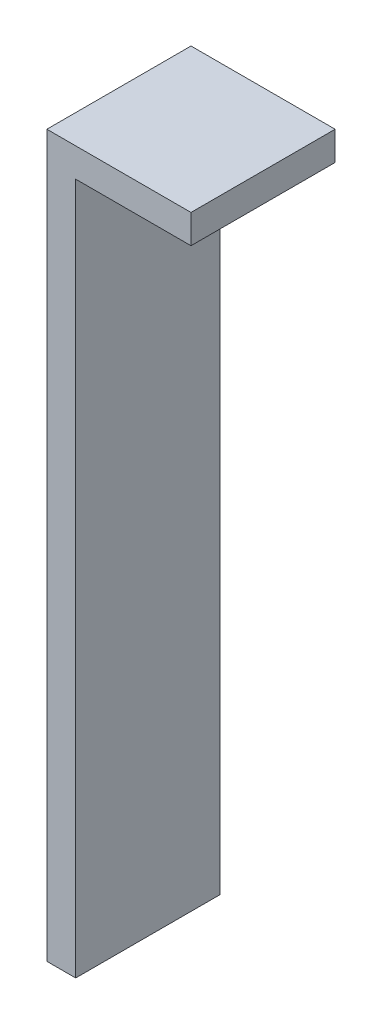
ISO-10303-21;
HEADER;
FILE_DESCRIPTION(('STEP AP214'),'2;1');
FILE_NAME('part.step','',(''),(''),'','','');
FILE_SCHEMA(('AUTOMOTIVE_DESIGN { 1 0 10303 214 1 1 1 1 }'));
ENDSEC;
DATA;
#1=APPLICATION_CONTEXT('core data for automotive mechanical design processes');
#2=APPLICATION_PROTOCOL_DEFINITION('international standard','automotive_design',2000,#1);
#3=PRODUCT_CONTEXT('',#1,'mechanical');
#4=PRODUCT('Part','Part','',(#3));
#5=PRODUCT_RELATED_PRODUCT_CATEGORY('part','',(#4));
#6=PRODUCT_DEFINITION_FORMATION('','',#4);
#7=PRODUCT_DEFINITION_CONTEXT('part definition',#1,'design');
#8=PRODUCT_DEFINITION('design','',#6,#7);
#9=PRODUCT_DEFINITION_SHAPE('','',#8);
#10=(LENGTH_UNIT() NAMED_UNIT(*) SI_UNIT(.MILLI.,.METRE.));
#11=(NAMED_UNIT(*) PLANE_ANGLE_UNIT() SI_UNIT($,.RADIAN.));
#12=(NAMED_UNIT(*) SI_UNIT($,.STERADIAN.) SOLID_ANGLE_UNIT());
#13=UNCERTAINTY_MEASURE_WITH_UNIT(LENGTH_MEASURE(1.E-05),#10,'distance_accuracy_value','');
#14=(GEOMETRIC_REPRESENTATION_CONTEXT(3) GLOBAL_UNCERTAINTY_ASSIGNED_CONTEXT((#13)) GLOBAL_UNIT_ASSIGNED_CONTEXT((#10,
#11,#12)) REPRESENTATION_CONTEXT('',''));
#15=CARTESIAN_POINT('',(0.,0.,0.));
#16=DIRECTION('',(0.,0.,1.));
#17=DIRECTION('',(1.,0.,0.));
#18=AXIS2_PLACEMENT_3D('',#15,#16,#17);
#19=CARTESIAN_POINT('',(0.,-0.2,0.5));
#20=DIRECTION('',(-1.,0.,0.));
#21=DIRECTION('',(0.,0.,1.));
#22=AXIS2_PLACEMENT_3D('',#19,#20,#21);
#23=PLANE('',#22);
#24=DIRECTION('',(0.,1.,0.));
#25=VECTOR('',#24,1.);
#26=CARTESIAN_POINT('',(0.,-0.2,-0.5));
#27=LINE('',#26,#25);
#28=CARTESIAN_POINT('',(0.,-0.2,-0.5));
#29=VERTEX_POINT('',#28);
#30=CARTESIAN_POINT('',(0.,0.,-0.5));
#31=VERTEX_POINT('',#30);
#32=EDGE_CURVE('E116',#29,#31,#27,.T.);
#33=ORIENTED_EDGE('',*,*,#32,.T.);
#34=DIRECTION('',(0.,0.,-1.));
#35=VECTOR('',#34,1.);
#36=CARTESIAN_POINT('',(0.,0.,0.5));
#37=LINE('',#36,#35);
#38=CARTESIAN_POINT('',(0.,0.,0.5));
#39=VERTEX_POINT('',#38);
#40=EDGE_CURVE('E11',#39,#31,#37,.T.);
#41=ORIENTED_EDGE('',*,*,#40,.F.);
#42=DIRECTION('',(0.,1.,0.));
#43=VECTOR('',#42,1.);
#44=CARTESIAN_POINT('',(0.,-0.2,0.5));
#45=LINE('',#44,#43);
#46=CARTESIAN_POINT('',(0.,-0.2,0.5));
#47=VERTEX_POINT('',#46);
#48=EDGE_CURVE('E126',#47,#39,#45,.T.);
#49=ORIENTED_EDGE('',*,*,#48,.F.);
#50=DIRECTION('',(0.,0.,-1.));
#51=VECTOR('',#50,1.);
#52=CARTESIAN_POINT('',(0.,-0.2,0.5));
#53=LINE('',#52,#51);
#54=EDGE_CURVE('E112',#47,#29,#53,.T.);
#55=ORIENTED_EDGE('',*,*,#54,.T.);
#56=EDGE_LOOP('',(#33,#41,#49,#55));
#57=FACE_BOUND('',#56,.T.);
#58=ADVANCED_FACE('F32',(#57),#23,.F.);
#59=CARTESIAN_POINT('',(0.,0.,0.5));
#60=DIRECTION('',(0.,-1.,0.));
#61=DIRECTION('',(1.,0.,0.));
#62=AXIS2_PLACEMENT_3D('',#59,#60,#61);
#63=PLANE('',#62);
#64=DIRECTION('',(-1.,0.,0.));
#65=VECTOR('',#64,1.);
#66=CARTESIAN_POINT('',(0.,0.,-0.5));
#67=LINE('',#66,#65);
#68=CARTESIAN_POINT('',(-1.,0.,-0.5));
#69=VERTEX_POINT('',#68);
#70=EDGE_CURVE('E119',#31,#69,#67,.T.);
#71=ORIENTED_EDGE('',*,*,#70,.T.);
#72=DIRECTION('',(0.,0.,-1.));
#73=VECTOR('',#72,1.);
#74=CARTESIAN_POINT('',(-1.,0.,0.5));
#75=LINE('',#74,#73);
#76=CARTESIAN_POINT('',(-1.,0.,0.5));
#77=VERTEX_POINT('',#76);
#78=EDGE_CURVE('E40',#77,#69,#75,.T.);
#79=ORIENTED_EDGE('',*,*,#78,.F.);
#80=DIRECTION('',(-1.,0.,0.));
#81=VECTOR('',#80,1.);
#82=CARTESIAN_POINT('',(0.,0.,0.5));
#83=LINE('',#82,#81);
#84=EDGE_CURVE('E85',#39,#77,#83,.T.);
#85=ORIENTED_EDGE('',*,*,#84,.F.);
#86=ORIENTED_EDGE('',*,*,#40,.T.);
#87=EDGE_LOOP('',(#71,#79,#85,#86));
#88=FACE_BOUND('',#87,.T.);
#89=ADVANCED_FACE('F150',(#88),#63,.F.);
#90=CARTESIAN_POINT('',(-1.,0.,0.5));
#91=DIRECTION('',(1.,0.,0.));
#92=DIRECTION('',(0.,1.,0.));
#93=AXIS2_PLACEMENT_3D('',#90,#91,#92);
#94=PLANE('',#93);
#95=DIRECTION('',(0.,-1.,0.));
#96=VECTOR('',#95,1.);
#97=CARTESIAN_POINT('',(-1.,0.,-0.5));
#98=LINE('',#97,#96);
#99=CARTESIAN_POINT('',(-1.,-5.,-0.5));
#100=VERTEX_POINT('',#99);
#101=EDGE_CURVE('E121',#69,#100,#98,.T.);
#102=ORIENTED_EDGE('',*,*,#101,.T.);
#103=DIRECTION('',(0.,0.,-1.));
#104=VECTOR('',#103,1.);
#105=CARTESIAN_POINT('',(-1.,-5.,0.5));
#106=LINE('',#105,#104);
#107=CARTESIAN_POINT('',(-1.,-5.,0.5));
#108=VERTEX_POINT('',#107);
#109=EDGE_CURVE('E107',#108,#100,#106,.T.);
#110=ORIENTED_EDGE('',*,*,#109,.F.);
#111=DIRECTION('',(0.,-1.,0.));
#112=VECTOR('',#111,1.);
#113=CARTESIAN_POINT('',(-1.,0.,0.5));
#114=LINE('',#113,#112);
#115=EDGE_CURVE('E98',#77,#108,#114,.T.);
#116=ORIENTED_EDGE('',*,*,#115,.F.);
#117=ORIENTED_EDGE('',*,*,#78,.T.);
#118=EDGE_LOOP('',(#102,#110,#116,#117));
#119=FACE_BOUND('',#118,.T.);
#120=ADVANCED_FACE('F132',(#119),#94,.F.);
#121=CARTESIAN_POINT('',(-1.,-5.,0.5));
#122=DIRECTION('',(0.,1.,0.));
#123=DIRECTION('',(0.,0.,1.));
#124=AXIS2_PLACEMENT_3D('',#121,#122,#123);
#125=PLANE('',#124);
#126=DIRECTION('',(1.,0.,0.));
#127=VECTOR('',#126,1.);
#128=CARTESIAN_POINT('',(-1.,-5.,-0.5));
#129=LINE('',#128,#127);
#130=CARTESIAN_POINT('',(-0.799999999999999,-5.,-0.5));
#131=VERTEX_POINT('',#130);
#132=EDGE_CURVE('E106',#100,#131,#129,.T.);
#133=ORIENTED_EDGE('',*,*,#132,.T.);
#134=DIRECTION('',(0.,0.,-1.));
#135=VECTOR('',#134,1.);
#136=CARTESIAN_POINT('',(-0.799999999999999,-5.,0.5));
#137=LINE('',#136,#135);
#138=CARTESIAN_POINT('',(-0.799999999999999,-5.,0.5));
#139=VERTEX_POINT('',#138);
#140=EDGE_CURVE('E103',#139,#131,#137,.T.);
#141=ORIENTED_EDGE('',*,*,#140,.F.);
#142=DIRECTION('',(1.,0.,0.));
#143=VECTOR('',#142,1.);
#144=CARTESIAN_POINT('',(-1.,-5.,0.5));
#145=LINE('',#144,#143);
#146=EDGE_CURVE('E92',#108,#139,#145,.T.);
#147=ORIENTED_EDGE('',*,*,#146,.F.);
#148=ORIENTED_EDGE('',*,*,#109,.T.);
#149=EDGE_LOOP('',(#133,#141,#147,#148));
#150=FACE_BOUND('',#149,.T.);
#151=ADVANCED_FACE('F104',(#150),#125,.F.);
#152=CARTESIAN_POINT('',(-0.799999999999999,-5.,0.5));
#153=DIRECTION('',(-1.,0.,0.));
#154=DIRECTION('',(0.,-1.,0.));
#155=AXIS2_PLACEMENT_3D('',#152,#153,#154);
#156=PLANE('',#155);
#157=DIRECTION('',(0.,1.,0.));
#158=VECTOR('',#157,1.);
#159=CARTESIAN_POINT('',(-0.799999999999999,-5.,-0.5));
#160=LINE('',#159,#158);
#161=CARTESIAN_POINT('',(-0.8,-0.2,-0.5));
#162=VERTEX_POINT('',#161);
#163=EDGE_CURVE('E71',#131,#162,#160,.T.);
#164=ORIENTED_EDGE('',*,*,#163,.T.);
#165=DIRECTION('',(0.,0.,-1.));
#166=VECTOR('',#165,1.);
#167=CARTESIAN_POINT('',(-0.8,-0.2,0.5));
#168=LINE('',#167,#166);
#169=CARTESIAN_POINT('',(-0.8,-0.2,0.5));
#170=VERTEX_POINT('',#169);
#171=EDGE_CURVE('E108',#170,#162,#168,.T.);
#172=ORIENTED_EDGE('',*,*,#171,.F.);
#173=DIRECTION('',(0.,1.,0.));
#174=VECTOR('',#173,1.);
#175=CARTESIAN_POINT('',(-0.799999999999999,-5.,0.5));
#176=LINE('',#175,#174);
#177=EDGE_CURVE('E96',#139,#170,#176,.T.);
#178=ORIENTED_EDGE('',*,*,#177,.F.);
#179=ORIENTED_EDGE('',*,*,#140,.T.);
#180=EDGE_LOOP('',(#164,#172,#178,#179));
#181=FACE_BOUND('',#180,.T.);
#182=ADVANCED_FACE('F110',(#181),#156,.F.);
#183=CARTESIAN_POINT('',(-0.8,-0.2,0.5));
#184=DIRECTION('',(0.,1.,0.));
#185=DIRECTION('',(0.,0.,1.));
#186=AXIS2_PLACEMENT_3D('',#183,#184,#185);
#187=PLANE('',#186);
#188=DIRECTION('',(1.,0.,0.));
#189=VECTOR('',#188,1.);
#190=CARTESIAN_POINT('',(-0.8,-0.2,-0.5));
#191=LINE('',#190,#189);
#192=EDGE_CURVE('E77',#162,#29,#191,.T.);
#193=ORIENTED_EDGE('',*,*,#192,.T.);
#194=ORIENTED_EDGE('',*,*,#54,.F.);
#195=DIRECTION('',(1.,0.,0.));
#196=VECTOR('',#195,1.);
#197=CARTESIAN_POINT('',(-0.8,-0.2,0.5));
#198=LINE('',#197,#196);
#199=EDGE_CURVE('E48',#170,#47,#198,.T.);
#200=ORIENTED_EDGE('',*,*,#199,.F.);
#201=ORIENTED_EDGE('',*,*,#171,.T.);
#202=EDGE_LOOP('',(#193,#194,#200,#201));
#203=FACE_BOUND('',#202,.T.);
#204=ADVANCED_FACE('F139',(#203),#187,.F.);
#205=CARTESIAN_POINT('',(0.,0.,0.5));
#206=DIRECTION('',(0.,0.,1.));
#207=DIRECTION('',(1.,0.,0.));
#208=AXIS2_PLACEMENT_3D('',#205,#206,#207);
#209=PLANE('',#208);
#210=ORIENTED_EDGE('',*,*,#48,.T.);
#211=ORIENTED_EDGE('',*,*,#84,.T.);
#212=ORIENTED_EDGE('',*,*,#115,.T.);
#213=ORIENTED_EDGE('',*,*,#146,.T.);
#214=ORIENTED_EDGE('',*,*,#177,.T.);
#215=ORIENTED_EDGE('',*,*,#199,.T.);
#216=EDGE_LOOP('',(#210,#211,#212,#213,#214,#215));
#217=FACE_BOUND('',#216,.T.);
#218=ADVANCED_FACE('F94',(#217),#209,.T.);
#219=CARTESIAN_POINT('',(0.,0.,-0.5));
#220=DIRECTION('',(0.,0.,1.));
#221=DIRECTION('',(1.,0.,0.));
#222=AXIS2_PLACEMENT_3D('',#219,#220,#221);
#223=PLANE('',#222);
#224=ORIENTED_EDGE('',*,*,#32,.F.);
#225=ORIENTED_EDGE('',*,*,#192,.F.);
#226=ORIENTED_EDGE('',*,*,#163,.F.);
#227=ORIENTED_EDGE('',*,*,#132,.F.);
#228=ORIENTED_EDGE('',*,*,#101,.F.);
#229=ORIENTED_EDGE('',*,*,#70,.F.);
#230=EDGE_LOOP('',(#224,#225,#226,#227,#228,#229));
#231=FACE_BOUND('',#230,.T.);
#232=ADVANCED_FACE('F135',(#231),#223,.F.);
#233=CLOSED_SHELL('',(#58,#89,#120,#151,#182,#204,#218,#232));
#234=MANIFOLD_SOLID_BREP('B2',#233);
#235=ADVANCED_BREP_SHAPE_REPRESENTATION('',(#18,#234),#14);
#236=SHAPE_DEFINITION_REPRESENTATION(#9,#235);
ENDSEC;
END-ISO-10303-21;
